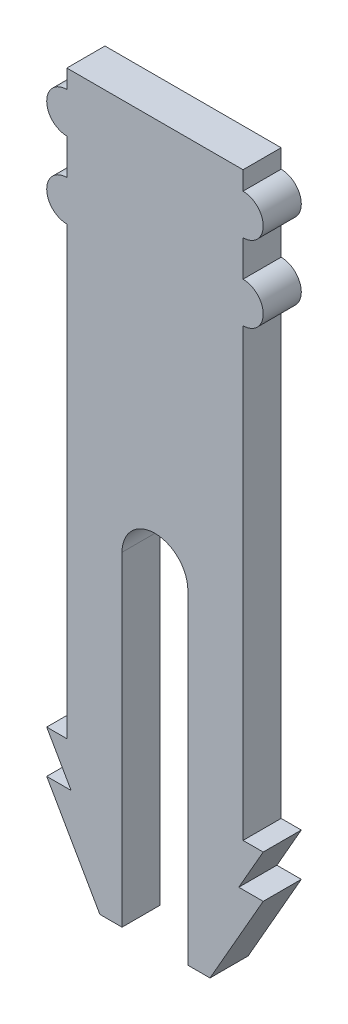
ISO-10303-21;
HEADER;
FILE_DESCRIPTION(('STEP AP214'),'2;1');
FILE_NAME('part.step','',(''),(''),'','','');
FILE_SCHEMA(('AUTOMOTIVE_DESIGN { 1 0 10303 214 1 1 1 1 }'));
ENDSEC;
DATA;
#1=APPLICATION_CONTEXT('core data for automotive mechanical design processes');
#2=APPLICATION_PROTOCOL_DEFINITION('international standard','automotive_design',2000,#1);
#3=PRODUCT_CONTEXT('',#1,'mechanical');
#4=PRODUCT('Part','Part','',(#3));
#5=PRODUCT_RELATED_PRODUCT_CATEGORY('part','',(#4));
#6=PRODUCT_DEFINITION_FORMATION('','',#4);
#7=PRODUCT_DEFINITION_CONTEXT('part definition',#1,'design');
#8=PRODUCT_DEFINITION('design','',#6,#7);
#9=PRODUCT_DEFINITION_SHAPE('','',#8);
#10=(LENGTH_UNIT() NAMED_UNIT(*) SI_UNIT(.MILLI.,.METRE.));
#11=(NAMED_UNIT(*) PLANE_ANGLE_UNIT() SI_UNIT($,.RADIAN.));
#12=(NAMED_UNIT(*) SI_UNIT($,.STERADIAN.) SOLID_ANGLE_UNIT());
#13=UNCERTAINTY_MEASURE_WITH_UNIT(LENGTH_MEASURE(1.E-05),#10,'distance_accuracy_value','');
#14=(GEOMETRIC_REPRESENTATION_CONTEXT(3) GLOBAL_UNCERTAINTY_ASSIGNED_CONTEXT((#13)) GLOBAL_UNIT_ASSIGNED_CONTEXT((#10,
#11,#12)) REPRESENTATION_CONTEXT('',''));
#15=CARTESIAN_POINT('',(0.,0.,0.));
#16=DIRECTION('',(0.,0.,1.));
#17=DIRECTION('',(1.,0.,0.));
#18=AXIS2_PLACEMENT_3D('',#15,#16,#17);
#19=CARTESIAN_POINT('',(-0.71,-1.46,0.125));
#20=DIRECTION('',(0.868042753796934,0.496489453644925,0.));
#21=DIRECTION('',(-0.496489453644925,0.868042753796934,0.));
#22=AXIS2_PLACEMENT_3D('',#19,#20,#21);
#23=PLANE('',#22);
#24=DIRECTION('',(0.496489453644925,-0.868042753796934,0.));
#25=VECTOR('',#24,1.);
#26=CARTESIAN_POINT('',(-0.71,-1.46,-0.125));
#27=LINE('',#26,#25);
#28=CARTESIAN_POINT('',(-0.71,-1.46,-0.125));
#29=VERTEX_POINT('',#28);
#30=CARTESIAN_POINT('',(-0.54985,-1.74,-0.125));
#31=VERTEX_POINT('',#30);
#32=EDGE_CURVE('E11',#29,#31,#27,.T.);
#33=ORIENTED_EDGE('',*,*,#32,.T.);
#34=DIRECTION('',(0.,0.,-1.));
#35=VECTOR('',#34,1.);
#36=CARTESIAN_POINT('',(-0.54985,-1.74,0.125));
#37=LINE('',#36,#35);
#38=CARTESIAN_POINT('',(-0.54985,-1.74,0.125));
#39=VERTEX_POINT('',#38);
#40=EDGE_CURVE('E25',#39,#31,#37,.T.);
#41=ORIENTED_EDGE('',*,*,#40,.F.);
#42=DIRECTION('',(0.496489453644925,-0.868042753796934,0.));
#43=VECTOR('',#42,1.);
#44=CARTESIAN_POINT('',(-0.71,-1.46,0.125));
#45=LINE('',#44,#43);
#46=CARTESIAN_POINT('',(-0.71,-1.46,0.125));
#47=VERTEX_POINT('',#46);
#48=EDGE_CURVE('E499',#47,#39,#45,.T.);
#49=ORIENTED_EDGE('',*,*,#48,.F.);
#50=DIRECTION('',(0.,0.,-1.));
#51=VECTOR('',#50,1.);
#52=CARTESIAN_POINT('',(-0.71,-1.46,0.125));
#53=LINE('',#52,#51);
#54=EDGE_CURVE('E495',#47,#29,#53,.T.);
#55=ORIENTED_EDGE('',*,*,#54,.T.);
#56=EDGE_LOOP('',(#33,#41,#49,#55));
#57=FACE_BOUND('',#56,.T.);
#58=ADVANCED_FACE('F17',(#57),#23,.F.);
#59=CARTESIAN_POINT('',(-0.57785,-1.46,0.125));
#60=DIRECTION('',(0.,-1.,0.));
#61=DIRECTION('',(0.,0.,-1.));
#62=AXIS2_PLACEMENT_3D('',#59,#60,#61);
#63=PLANE('',#62);
#64=DIRECTION('',(-1.,0.,0.));
#65=VECTOR('',#64,1.);
#66=CARTESIAN_POINT('',(-0.57785,-1.46,-0.125));
#67=LINE('',#66,#65);
#68=CARTESIAN_POINT('',(-0.57785,-1.46,-0.125));
#69=VERTEX_POINT('',#68);
#70=EDGE_CURVE('E490',#69,#29,#67,.T.);
#71=ORIENTED_EDGE('',*,*,#70,.T.);
#72=ORIENTED_EDGE('',*,*,#54,.F.);
#73=DIRECTION('',(-1.,0.,0.));
#74=VECTOR('',#73,1.);
#75=CARTESIAN_POINT('',(-0.57785,-1.46,0.125));
#76=LINE('',#75,#74);
#77=CARTESIAN_POINT('',(-0.57785,-1.46,0.125));
#78=VERTEX_POINT('',#77);
#79=EDGE_CURVE('E485',#78,#47,#76,.T.);
#80=ORIENTED_EDGE('',*,*,#79,.F.);
#81=DIRECTION('',(0.,0.,-1.));
#82=VECTOR('',#81,1.);
#83=CARTESIAN_POINT('',(-0.57785,-1.46,0.125));
#84=LINE('',#83,#82);
#85=EDGE_CURVE('E481',#78,#69,#84,.T.);
#86=ORIENTED_EDGE('',*,*,#85,.T.);
#87=EDGE_LOOP('',(#71,#72,#80,#86));
#88=FACE_BOUND('',#87,.T.);
#89=ADVANCED_FACE('F511',(#88),#63,.F.);
#90=CARTESIAN_POINT('',(-0.57785,1.46385,0.125));
#91=DIRECTION('',(1.,0.,0.));
#92=DIRECTION('',(0.,0.,-1.));
#93=AXIS2_PLACEMENT_3D('',#90,#91,#92);
#94=PLANE('',#93);
#95=DIRECTION('',(0.,-1.,0.));
#96=VECTOR('',#95,1.);
#97=CARTESIAN_POINT('',(-0.57785,1.46385,-0.125));
#98=LINE('',#97,#96);
#99=CARTESIAN_POINT('',(-0.57785,1.46385,-0.125));
#100=VERTEX_POINT('',#99);
#101=EDGE_CURVE('E476',#100,#69,#98,.T.);
#102=ORIENTED_EDGE('',*,*,#101,.T.);
#103=ORIENTED_EDGE('',*,*,#85,.F.);
#104=DIRECTION('',(0.,-1.,0.));
#105=VECTOR('',#104,1.);
#106=CARTESIAN_POINT('',(-0.57785,1.46385,0.125));
#107=LINE('',#106,#105);
#108=CARTESIAN_POINT('',(-0.57785,1.46385,0.125));
#109=VERTEX_POINT('',#108);
#110=EDGE_CURVE('E471',#109,#78,#107,.T.);
#111=ORIENTED_EDGE('',*,*,#110,.F.);
#112=DIRECTION('',(0.,0.,-1.));
#113=VECTOR('',#112,1.);
#114=CARTESIAN_POINT('',(-0.57785,1.46385,0.125));
#115=LINE('',#114,#113);
#116=EDGE_CURVE('E467',#109,#100,#115,.T.);
#117=ORIENTED_EDGE('',*,*,#116,.T.);
#118=EDGE_LOOP('',(#102,#103,#111,#117));
#119=FACE_BOUND('',#118,.T.);
#120=ADVANCED_FACE('F518',(#119),#94,.F.);
#121=CARTESIAN_POINT('',(-0.57785,1.596,0.125));
#122=DIRECTION('',(0.,0.,1.));
#123=DIRECTION('',(1.,0.,0.));
#124=AXIS2_PLACEMENT_3D('',#121,#122,#123);
#125=CYLINDRICAL_SURFACE('',#124,0.13215);
#126=CARTESIAN_POINT('',(-0.57785,1.596,-0.125));
#127=DIRECTION('',(0.,0.,1.));
#128=DIRECTION('',(1.,0.,0.));
#129=AXIS2_PLACEMENT_3D('',#126,#127,#128);
#130=CIRCLE('',#129,0.13215);
#131=CARTESIAN_POINT('',(-0.57785,1.72815,-0.125));
#132=VERTEX_POINT('',#131);
#133=EDGE_CURVE('E462',#132,#100,#130,.T.);
#134=ORIENTED_EDGE('',*,*,#133,.T.);
#135=ORIENTED_EDGE('',*,*,#116,.F.);
#136=CARTESIAN_POINT('',(-0.57785,1.596,0.125));
#137=DIRECTION('',(0.,0.,1.));
#138=DIRECTION('',(1.,0.,0.));
#139=AXIS2_PLACEMENT_3D('',#136,#137,#138);
#140=CIRCLE('',#139,0.13215);
#141=CARTESIAN_POINT('',(-0.57785,1.72815,0.125));
#142=VERTEX_POINT('',#141);
#143=EDGE_CURVE('E457',#142,#109,#140,.T.);
#144=ORIENTED_EDGE('',*,*,#143,.F.);
#145=DIRECTION('',(0.,0.,-1.));
#146=VECTOR('',#145,1.);
#147=CARTESIAN_POINT('',(-0.57785,1.72815,0.125));
#148=LINE('',#147,#146);
#149=EDGE_CURVE('E453',#142,#132,#148,.T.);
#150=ORIENTED_EDGE('',*,*,#149,.T.);
#151=EDGE_LOOP('',(#134,#135,#144,#150));
#152=FACE_BOUND('',#151,.T.);
#153=ADVANCED_FACE('F521',(#152),#125,.T.);
#154=CARTESIAN_POINT('',(-0.57785,1.96385,0.125));
#155=DIRECTION('',(1.,0.,0.));
#156=DIRECTION('',(0.,0.,-1.));
#157=AXIS2_PLACEMENT_3D('',#154,#155,#156);
#158=PLANE('',#157);
#159=DIRECTION('',(0.,-1.,0.));
#160=VECTOR('',#159,1.);
#161=CARTESIAN_POINT('',(-0.57785,1.96385,-0.125));
#162=LINE('',#161,#160);
#163=CARTESIAN_POINT('',(-0.57785,1.96385,-0.125));
#164=VERTEX_POINT('',#163);
#165=EDGE_CURVE('E448',#164,#132,#162,.T.);
#166=ORIENTED_EDGE('',*,*,#165,.T.);
#167=ORIENTED_EDGE('',*,*,#149,.F.);
#168=DIRECTION('',(0.,-1.,0.));
#169=VECTOR('',#168,1.);
#170=CARTESIAN_POINT('',(-0.57785,1.96385,0.125));
#171=LINE('',#170,#169);
#172=CARTESIAN_POINT('',(-0.57785,1.96385,0.125));
#173=VERTEX_POINT('',#172);
#174=EDGE_CURVE('E443',#173,#142,#171,.T.);
#175=ORIENTED_EDGE('',*,*,#174,.F.);
#176=DIRECTION('',(0.,0.,-1.));
#177=VECTOR('',#176,1.);
#178=CARTESIAN_POINT('',(-0.57785,1.96385,0.125));
#179=LINE('',#178,#177);
#180=EDGE_CURVE('E439',#173,#164,#179,.T.);
#181=ORIENTED_EDGE('',*,*,#180,.T.);
#182=EDGE_LOOP('',(#166,#167,#175,#181));
#183=FACE_BOUND('',#182,.T.);
#184=ADVANCED_FACE('F524',(#183),#158,.F.);
#185=CARTESIAN_POINT('',(-0.57785,2.096,0.125));
#186=DIRECTION('',(0.,0.,1.));
#187=DIRECTION('',(1.,0.,0.));
#188=AXIS2_PLACEMENT_3D('',#185,#186,#187);
#189=CYLINDRICAL_SURFACE('',#188,0.13215);
#190=CARTESIAN_POINT('',(-0.57785,2.096,-0.125));
#191=DIRECTION('',(0.,0.,1.));
#192=DIRECTION('',(1.,0.,0.));
#193=AXIS2_PLACEMENT_3D('',#190,#191,#192);
#194=CIRCLE('',#193,0.13215);
#195=CARTESIAN_POINT('',(-0.57785,2.22815,-0.125));
#196=VERTEX_POINT('',#195);
#197=EDGE_CURVE('E434',#196,#164,#194,.T.);
#198=ORIENTED_EDGE('',*,*,#197,.T.);
#199=ORIENTED_EDGE('',*,*,#180,.F.);
#200=CARTESIAN_POINT('',(-0.57785,2.096,0.125));
#201=DIRECTION('',(0.,0.,1.));
#202=DIRECTION('',(1.,0.,0.));
#203=AXIS2_PLACEMENT_3D('',#200,#201,#202);
#204=CIRCLE('',#203,0.13215);
#205=CARTESIAN_POINT('',(-0.57785,2.22815,0.125));
#206=VERTEX_POINT('',#205);
#207=EDGE_CURVE('E429',#206,#173,#204,.T.);
#208=ORIENTED_EDGE('',*,*,#207,.F.);
#209=DIRECTION('',(0.,0.,-1.));
#210=VECTOR('',#209,1.);
#211=CARTESIAN_POINT('',(-0.57785,2.22815,0.125));
#212=LINE('',#211,#210);
#213=EDGE_CURVE('E425',#206,#196,#212,.T.);
#214=ORIENTED_EDGE('',*,*,#213,.T.);
#215=EDGE_LOOP('',(#198,#199,#208,#214));
#216=FACE_BOUND('',#215,.T.);
#217=ADVANCED_FACE('F530',(#216),#189,.T.);
#218=CARTESIAN_POINT('',(-0.57785,2.35,0.125));
#219=DIRECTION('',(1.,0.,0.));
#220=DIRECTION('',(0.,0.,-1.));
#221=AXIS2_PLACEMENT_3D('',#218,#219,#220);
#222=PLANE('',#221);
#223=DIRECTION('',(0.,-1.,0.));
#224=VECTOR('',#223,1.);
#225=CARTESIAN_POINT('',(-0.57785,2.35,-0.125));
#226=LINE('',#225,#224);
#227=CARTESIAN_POINT('',(-0.57785,2.35,-0.125));
#228=VERTEX_POINT('',#227);
#229=EDGE_CURVE('E420',#228,#196,#226,.T.);
#230=ORIENTED_EDGE('',*,*,#229,.T.);
#231=ORIENTED_EDGE('',*,*,#213,.F.);
#232=DIRECTION('',(0.,-1.,0.));
#233=VECTOR('',#232,1.);
#234=CARTESIAN_POINT('',(-0.57785,2.35,0.125));
#235=LINE('',#234,#233);
#236=CARTESIAN_POINT('',(-0.57785,2.35,0.125));
#237=VERTEX_POINT('',#236);
#238=EDGE_CURVE('E415',#237,#206,#235,.T.);
#239=ORIENTED_EDGE('',*,*,#238,.F.);
#240=DIRECTION('',(0.,0.,-1.));
#241=VECTOR('',#240,1.);
#242=CARTESIAN_POINT('',(-0.57785,2.35,0.125));
#243=LINE('',#242,#241);
#244=EDGE_CURVE('E411',#237,#228,#243,.T.);
#245=ORIENTED_EDGE('',*,*,#244,.T.);
#246=EDGE_LOOP('',(#230,#231,#239,#245));
#247=FACE_BOUND('',#246,.T.);
#248=ADVANCED_FACE('F533',(#247),#222,.F.);
#249=CARTESIAN_POINT('',(0.57785,2.35,0.125));
#250=DIRECTION('',(0.,-1.,0.));
#251=DIRECTION('',(0.,0.,-1.));
#252=AXIS2_PLACEMENT_3D('',#249,#250,#251);
#253=PLANE('',#252);
#254=DIRECTION('',(-1.,0.,0.));
#255=VECTOR('',#254,1.);
#256=CARTESIAN_POINT('',(0.57785,2.35,-0.125));
#257=LINE('',#256,#255);
#258=CARTESIAN_POINT('',(0.57785,2.35,-0.125));
#259=VERTEX_POINT('',#258);
#260=EDGE_CURVE('E406',#259,#228,#257,.T.);
#261=ORIENTED_EDGE('',*,*,#260,.T.);
#262=ORIENTED_EDGE('',*,*,#244,.F.);
#263=DIRECTION('',(-1.,0.,0.));
#264=VECTOR('',#263,1.);
#265=CARTESIAN_POINT('',(0.57785,2.35,0.125));
#266=LINE('',#265,#264);
#267=CARTESIAN_POINT('',(0.57785,2.35,0.125));
#268=VERTEX_POINT('',#267);
#269=EDGE_CURVE('E401',#268,#237,#266,.T.);
#270=ORIENTED_EDGE('',*,*,#269,.F.);
#271=DIRECTION('',(0.,0.,-1.));
#272=VECTOR('',#271,1.);
#273=CARTESIAN_POINT('',(0.57785,2.35,0.125));
#274=LINE('',#273,#272);
#275=EDGE_CURVE('E397',#268,#259,#274,.T.);
#276=ORIENTED_EDGE('',*,*,#275,.T.);
#277=EDGE_LOOP('',(#261,#262,#270,#276));
#278=FACE_BOUND('',#277,.T.);
#279=ADVANCED_FACE('F536',(#278),#253,.F.);
#280=CARTESIAN_POINT('',(0.57785,2.22815,0.125));
#281=DIRECTION('',(-1.,0.,0.));
#282=DIRECTION('',(0.,0.,1.));
#283=AXIS2_PLACEMENT_3D('',#280,#281,#282);
#284=PLANE('',#283);
#285=DIRECTION('',(0.,1.,0.));
#286=VECTOR('',#285,1.);
#287=CARTESIAN_POINT('',(0.57785,2.22815,-0.125));
#288=LINE('',#287,#286);
#289=CARTESIAN_POINT('',(0.57785,2.22815,-0.125));
#290=VERTEX_POINT('',#289);
#291=EDGE_CURVE('E392',#290,#259,#288,.T.);
#292=ORIENTED_EDGE('',*,*,#291,.T.);
#293=ORIENTED_EDGE('',*,*,#275,.F.);
#294=DIRECTION('',(0.,1.,0.));
#295=VECTOR('',#294,1.);
#296=CARTESIAN_POINT('',(0.57785,2.22815,0.125));
#297=LINE('',#296,#295);
#298=CARTESIAN_POINT('',(0.57785,2.22815,0.125));
#299=VERTEX_POINT('',#298);
#300=EDGE_CURVE('E387',#299,#268,#297,.T.);
#301=ORIENTED_EDGE('',*,*,#300,.F.);
#302=DIRECTION('',(0.,0.,-1.));
#303=VECTOR('',#302,1.);
#304=CARTESIAN_POINT('',(0.57785,2.22815,0.125));
#305=LINE('',#304,#303);
#306=EDGE_CURVE('E383',#299,#290,#305,.T.);
#307=ORIENTED_EDGE('',*,*,#306,.T.);
#308=EDGE_LOOP('',(#292,#293,#301,#307));
#309=FACE_BOUND('',#308,.T.);
#310=ADVANCED_FACE('F542',(#309),#284,.F.);
#311=CARTESIAN_POINT('',(0.57785,2.096,0.125));
#312=DIRECTION('',(0.,0.,1.));
#313=DIRECTION('',(-1.,0.,0.));
#314=AXIS2_PLACEMENT_3D('',#311,#312,#313);
#315=CYLINDRICAL_SURFACE('',#314,0.13215);
#316=CARTESIAN_POINT('',(0.57785,2.096,-0.125));
#317=DIRECTION('',(0.,0.,1.));
#318=DIRECTION('',(1.,0.,0.));
#319=AXIS2_PLACEMENT_3D('',#316,#317,#318);
#320=CIRCLE('',#319,0.13215);
#321=CARTESIAN_POINT('',(0.57785,1.96385,-0.125));
#322=VERTEX_POINT('',#321);
#323=EDGE_CURVE('E378',#322,#290,#320,.T.);
#324=ORIENTED_EDGE('',*,*,#323,.T.);
#325=ORIENTED_EDGE('',*,*,#306,.F.);
#326=CARTESIAN_POINT('',(0.57785,2.096,0.125));
#327=DIRECTION('',(0.,0.,1.));
#328=DIRECTION('',(1.,0.,0.));
#329=AXIS2_PLACEMENT_3D('',#326,#327,#328);
#330=CIRCLE('',#329,0.13215);
#331=CARTESIAN_POINT('',(0.57785,1.96385,0.125));
#332=VERTEX_POINT('',#331);
#333=EDGE_CURVE('E373',#332,#299,#330,.T.);
#334=ORIENTED_EDGE('',*,*,#333,.F.);
#335=DIRECTION('',(0.,0.,-1.));
#336=VECTOR('',#335,1.);
#337=CARTESIAN_POINT('',(0.57785,1.96385,0.125));
#338=LINE('',#337,#336);
#339=EDGE_CURVE('E369',#332,#322,#338,.T.);
#340=ORIENTED_EDGE('',*,*,#339,.T.);
#341=EDGE_LOOP('',(#324,#325,#334,#340));
#342=FACE_BOUND('',#341,.T.);
#343=ADVANCED_FACE('F545',(#342),#315,.T.);
#344=CARTESIAN_POINT('',(0.57785,1.72815,0.125));
#345=DIRECTION('',(-1.,0.,0.));
#346=DIRECTION('',(0.,0.,1.));
#347=AXIS2_PLACEMENT_3D('',#344,#345,#346);
#348=PLANE('',#347);
#349=DIRECTION('',(0.,1.,0.));
#350=VECTOR('',#349,1.);
#351=CARTESIAN_POINT('',(0.57785,1.72815,-0.125));
#352=LINE('',#351,#350);
#353=CARTESIAN_POINT('',(0.57785,1.72815,-0.125));
#354=VERTEX_POINT('',#353);
#355=EDGE_CURVE('E364',#354,#322,#352,.T.);
#356=ORIENTED_EDGE('',*,*,#355,.T.);
#357=ORIENTED_EDGE('',*,*,#339,.F.);
#358=DIRECTION('',(0.,1.,0.));
#359=VECTOR('',#358,1.);
#360=CARTESIAN_POINT('',(0.57785,1.72815,0.125));
#361=LINE('',#360,#359);
#362=CARTESIAN_POINT('',(0.57785,1.72815,0.125));
#363=VERTEX_POINT('',#362);
#364=EDGE_CURVE('E359',#363,#332,#361,.T.);
#365=ORIENTED_EDGE('',*,*,#364,.F.);
#366=DIRECTION('',(0.,0.,-1.));
#367=VECTOR('',#366,1.);
#368=CARTESIAN_POINT('',(0.57785,1.72815,0.125));
#369=LINE('',#368,#367);
#370=EDGE_CURVE('E355',#363,#354,#369,.T.);
#371=ORIENTED_EDGE('',*,*,#370,.T.);
#372=EDGE_LOOP('',(#356,#357,#365,#371));
#373=FACE_BOUND('',#372,.T.);
#374=ADVANCED_FACE('F548',(#373),#348,.F.);
#375=CARTESIAN_POINT('',(0.57785,1.596,0.125));
#376=DIRECTION('',(0.,0.,1.));
#377=DIRECTION('',(-1.,0.,0.));
#378=AXIS2_PLACEMENT_3D('',#375,#376,#377);
#379=CYLINDRICAL_SURFACE('',#378,0.13215);
#380=CARTESIAN_POINT('',(0.57785,1.596,-0.125));
#381=DIRECTION('',(0.,0.,1.));
#382=DIRECTION('',(1.,0.,0.));
#383=AXIS2_PLACEMENT_3D('',#380,#381,#382);
#384=CIRCLE('',#383,0.13215);
#385=CARTESIAN_POINT('',(0.57785,1.46385,-0.125));
#386=VERTEX_POINT('',#385);
#387=EDGE_CURVE('E350',#386,#354,#384,.T.);
#388=ORIENTED_EDGE('',*,*,#387,.T.);
#389=ORIENTED_EDGE('',*,*,#370,.F.);
#390=CARTESIAN_POINT('',(0.57785,1.596,0.125));
#391=DIRECTION('',(0.,0.,1.));
#392=DIRECTION('',(1.,0.,0.));
#393=AXIS2_PLACEMENT_3D('',#390,#391,#392);
#394=CIRCLE('',#393,0.13215);
#395=CARTESIAN_POINT('',(0.57785,1.46385,0.125));
#396=VERTEX_POINT('',#395);
#397=EDGE_CURVE('E345',#396,#363,#394,.T.);
#398=ORIENTED_EDGE('',*,*,#397,.F.);
#399=DIRECTION('',(0.,0.,-1.));
#400=VECTOR('',#399,1.);
#401=CARTESIAN_POINT('',(0.57785,1.46385,0.125));
#402=LINE('',#401,#400);
#403=EDGE_CURVE('E341',#396,#386,#402,.T.);
#404=ORIENTED_EDGE('',*,*,#403,.T.);
#405=EDGE_LOOP('',(#388,#389,#398,#404));
#406=FACE_BOUND('',#405,.T.);
#407=ADVANCED_FACE('F554',(#406),#379,.T.);
#408=CARTESIAN_POINT('',(0.57785,-1.46,0.125));
#409=DIRECTION('',(-1.,0.,0.));
#410=DIRECTION('',(0.,0.,1.));
#411=AXIS2_PLACEMENT_3D('',#408,#409,#410);
#412=PLANE('',#411);
#413=DIRECTION('',(0.,1.,0.));
#414=VECTOR('',#413,1.);
#415=CARTESIAN_POINT('',(0.57785,-1.46,-0.125));
#416=LINE('',#415,#414);
#417=CARTESIAN_POINT('',(0.57785,-1.46,-0.125));
#418=VERTEX_POINT('',#417);
#419=EDGE_CURVE('E336',#418,#386,#416,.T.);
#420=ORIENTED_EDGE('',*,*,#419,.T.);
#421=ORIENTED_EDGE('',*,*,#403,.F.);
#422=DIRECTION('',(0.,1.,0.));
#423=VECTOR('',#422,1.);
#424=CARTESIAN_POINT('',(0.57785,-1.46,0.125));
#425=LINE('',#424,#423);
#426=CARTESIAN_POINT('',(0.57785,-1.46,0.125));
#427=VERTEX_POINT('',#426);
#428=EDGE_CURVE('E331',#427,#396,#425,.T.);
#429=ORIENTED_EDGE('',*,*,#428,.F.);
#430=DIRECTION('',(0.,0.,-1.));
#431=VECTOR('',#430,1.);
#432=CARTESIAN_POINT('',(0.57785,-1.46,0.125));
#433=LINE('',#432,#431);
#434=EDGE_CURVE('E327',#427,#418,#433,.T.);
#435=ORIENTED_EDGE('',*,*,#434,.T.);
#436=EDGE_LOOP('',(#420,#421,#429,#435));
#437=FACE_BOUND('',#436,.T.);
#438=ADVANCED_FACE('F557',(#437),#412,.F.);
#439=CARTESIAN_POINT('',(0.71,-1.46,0.125));
#440=DIRECTION('',(0.,-1.,0.));
#441=DIRECTION('',(0.,0.,-1.));
#442=AXIS2_PLACEMENT_3D('',#439,#440,#441);
#443=PLANE('',#442);
#444=DIRECTION('',(-1.,0.,0.));
#445=VECTOR('',#444,1.);
#446=CARTESIAN_POINT('',(0.71,-1.46,-0.125));
#447=LINE('',#446,#445);
#448=CARTESIAN_POINT('',(0.71,-1.46,-0.125));
#449=VERTEX_POINT('',#448);
#450=EDGE_CURVE('E322',#449,#418,#447,.T.);
#451=ORIENTED_EDGE('',*,*,#450,.T.);
#452=ORIENTED_EDGE('',*,*,#434,.F.);
#453=DIRECTION('',(-1.,0.,0.));
#454=VECTOR('',#453,1.);
#455=CARTESIAN_POINT('',(0.71,-1.46,0.125));
#456=LINE('',#455,#454);
#457=CARTESIAN_POINT('',(0.71,-1.46,0.125));
#458=VERTEX_POINT('',#457);
#459=EDGE_CURVE('E317',#458,#427,#456,.T.);
#460=ORIENTED_EDGE('',*,*,#459,.F.);
#461=DIRECTION('',(0.,0.,-1.));
#462=VECTOR('',#461,1.);
#463=CARTESIAN_POINT('',(0.71,-1.46,0.125));
#464=LINE('',#463,#462);
#465=EDGE_CURVE('E313',#458,#449,#464,.T.);
#466=ORIENTED_EDGE('',*,*,#465,.T.);
#467=EDGE_LOOP('',(#451,#452,#460,#466));
#468=FACE_BOUND('',#467,.T.);
#469=ADVANCED_FACE('F560',(#468),#443,.F.);
#470=CARTESIAN_POINT('',(0.54985,-1.74,0.125));
#471=DIRECTION('',(-0.868042753796934,0.496489453644925,0.));
#472=DIRECTION('',(-0.496489453644925,-0.868042753796934,0.));
#473=AXIS2_PLACEMENT_3D('',#470,#471,#472);
#474=PLANE('',#473);
#475=DIRECTION('',(0.496489453644925,0.868042753796934,0.));
#476=VECTOR('',#475,1.);
#477=CARTESIAN_POINT('',(0.54985,-1.74,-0.125));
#478=LINE('',#477,#476);
#479=CARTESIAN_POINT('',(0.54985,-1.74,-0.125));
#480=VERTEX_POINT('',#479);
#481=EDGE_CURVE('E308',#480,#449,#478,.T.);
#482=ORIENTED_EDGE('',*,*,#481,.T.);
#483=ORIENTED_EDGE('',*,*,#465,.F.);
#484=DIRECTION('',(0.496489453644925,0.868042753796934,0.));
#485=VECTOR('',#484,1.);
#486=CARTESIAN_POINT('',(0.54985,-1.74,0.125));
#487=LINE('',#486,#485);
#488=CARTESIAN_POINT('',(0.54985,-1.74,0.125));
#489=VERTEX_POINT('',#488);
#490=EDGE_CURVE('E303',#489,#458,#487,.T.);
#491=ORIENTED_EDGE('',*,*,#490,.F.);
#492=DIRECTION('',(0.,0.,-1.));
#493=VECTOR('',#492,1.);
#494=CARTESIAN_POINT('',(0.54985,-1.74,0.125));
#495=LINE('',#494,#493);
#496=EDGE_CURVE('E299',#489,#480,#495,.T.);
#497=ORIENTED_EDGE('',*,*,#496,.T.);
#498=EDGE_LOOP('',(#482,#483,#491,#497));
#499=FACE_BOUND('',#498,.T.);
#500=ADVANCED_FACE('F566',(#499),#474,.F.);
#501=CARTESIAN_POINT('',(0.71,-1.74,0.125));
#502=DIRECTION('',(0.,-1.,0.));
#503=DIRECTION('',(0.,0.,-1.));
#504=AXIS2_PLACEMENT_3D('',#501,#502,#503);
#505=PLANE('',#504);
#506=DIRECTION('',(-1.,0.,0.));
#507=VECTOR('',#506,1.);
#508=CARTESIAN_POINT('',(0.71,-1.74,-0.125));
#509=LINE('',#508,#507);
#510=CARTESIAN_POINT('',(0.71,-1.74,-0.125));
#511=VERTEX_POINT('',#510);
#512=EDGE_CURVE('E294',#511,#480,#509,.T.);
#513=ORIENTED_EDGE('',*,*,#512,.T.);
#514=ORIENTED_EDGE('',*,*,#496,.F.);
#515=DIRECTION('',(-1.,0.,0.));
#516=VECTOR('',#515,1.);
#517=CARTESIAN_POINT('',(0.71,-1.74,0.125));
#518=LINE('',#517,#516);
#519=CARTESIAN_POINT('',(0.71,-1.74,0.125));
#520=VERTEX_POINT('',#519);
#521=EDGE_CURVE('E289',#520,#489,#518,.T.);
#522=ORIENTED_EDGE('',*,*,#521,.F.);
#523=DIRECTION('',(0.,0.,-1.));
#524=VECTOR('',#523,1.);
#525=CARTESIAN_POINT('',(0.71,-1.74,0.125));
#526=LINE('',#525,#524);
#527=EDGE_CURVE('E285',#520,#511,#526,.T.);
#528=ORIENTED_EDGE('',*,*,#527,.T.);
#529=EDGE_LOOP('',(#513,#514,#522,#528));
#530=FACE_BOUND('',#529,.T.);
#531=ADVANCED_FACE('F569',(#530),#505,.F.);
#532=CARTESIAN_POINT('',(0.36110178571429,-2.35,0.125));
#533=DIRECTION('',(-0.868042753796936,0.49648945364492,0.));
#534=DIRECTION('',(-0.49648945364492,-0.868042753796936,0.));
#535=AXIS2_PLACEMENT_3D('',#532,#533,#534);
#536=PLANE('',#535);
#537=DIRECTION('',(0.49648945364492,0.868042753796936,0.));
#538=VECTOR('',#537,1.);
#539=CARTESIAN_POINT('',(0.36110178571429,-2.35,-0.125));
#540=LINE('',#539,#538);
#541=CARTESIAN_POINT('',(0.36110178571429,-2.35,-0.125));
#542=VERTEX_POINT('',#541);
#543=EDGE_CURVE('E280',#542,#511,#540,.T.);
#544=ORIENTED_EDGE('',*,*,#543,.T.);
#545=ORIENTED_EDGE('',*,*,#527,.F.);
#546=DIRECTION('',(0.49648945364492,0.868042753796936,0.));
#547=VECTOR('',#546,1.);
#548=CARTESIAN_POINT('',(0.36110178571429,-2.35,0.125));
#549=LINE('',#548,#547);
#550=CARTESIAN_POINT('',(0.36110178571429,-2.35,0.125));
#551=VERTEX_POINT('',#550);
#552=EDGE_CURVE('E275',#551,#520,#549,.T.);
#553=ORIENTED_EDGE('',*,*,#552,.F.);
#554=DIRECTION('',(0.,0.,-1.));
#555=VECTOR('',#554,1.);
#556=CARTESIAN_POINT('',(0.36110178571429,-2.35,0.125));
#557=LINE('',#556,#555);
#558=EDGE_CURVE('E271',#551,#542,#557,.T.);
#559=ORIENTED_EDGE('',*,*,#558,.T.);
#560=EDGE_LOOP('',(#544,#545,#553,#559));
#561=FACE_BOUND('',#560,.T.);
#562=ADVANCED_FACE('F572',(#561),#536,.F.);
#563=CARTESIAN_POINT('',(0.2159,-2.35,0.125));
#564=DIRECTION('',(0.,1.,0.));
#565=DIRECTION('',(0.,0.,1.));
#566=AXIS2_PLACEMENT_3D('',#563,#564,#565);
#567=PLANE('',#566);
#568=DIRECTION('',(1.,0.,0.));
#569=VECTOR('',#568,1.);
#570=CARTESIAN_POINT('',(0.2159,-2.35,-0.125));
#571=LINE('',#570,#569);
#572=CARTESIAN_POINT('',(0.2159,-2.35,-0.125));
#573=VERTEX_POINT('',#572);
#574=EDGE_CURVE('E266',#573,#542,#571,.T.);
#575=ORIENTED_EDGE('',*,*,#574,.T.);
#576=ORIENTED_EDGE('',*,*,#558,.F.);
#577=DIRECTION('',(1.,0.,0.));
#578=VECTOR('',#577,1.);
#579=CARTESIAN_POINT('',(0.2159,-2.35,0.125));
#580=LINE('',#579,#578);
#581=CARTESIAN_POINT('',(0.2159,-2.35,0.125));
#582=VERTEX_POINT('',#581);
#583=EDGE_CURVE('E261',#582,#551,#580,.T.);
#584=ORIENTED_EDGE('',*,*,#583,.F.);
#585=DIRECTION('',(0.,0.,-1.));
#586=VECTOR('',#585,1.);
#587=CARTESIAN_POINT('',(0.2159,-2.35,0.125));
#588=LINE('',#587,#586);
#589=EDGE_CURVE('E257',#582,#573,#588,.T.);
#590=ORIENTED_EDGE('',*,*,#589,.T.);
#591=EDGE_LOOP('',(#575,#576,#584,#590));
#592=FACE_BOUND('',#591,.T.);
#593=ADVANCED_FACE('F577',(#592),#567,.F.);
#594=CARTESIAN_POINT('',(0.2159,-0.22,0.125));
#595=DIRECTION('',(1.,0.,0.));
#596=DIRECTION('',(0.,0.,-1.));
#597=AXIS2_PLACEMENT_3D('',#594,#595,#596);
#598=PLANE('',#597);
#599=DIRECTION('',(0.,-1.,0.));
#600=VECTOR('',#599,1.);
#601=CARTESIAN_POINT('',(0.2159,-0.22,-0.125));
#602=LINE('',#601,#600);
#603=CARTESIAN_POINT('',(0.2159,-0.22,-0.125));
#604=VERTEX_POINT('',#603);
#605=EDGE_CURVE('E252',#604,#573,#602,.T.);
#606=ORIENTED_EDGE('',*,*,#605,.T.);
#607=ORIENTED_EDGE('',*,*,#589,.F.);
#608=DIRECTION('',(0.,-1.,0.));
#609=VECTOR('',#608,1.);
#610=CARTESIAN_POINT('',(0.2159,-0.22,0.125));
#611=LINE('',#610,#609);
#612=CARTESIAN_POINT('',(0.2159,-0.22,0.125));
#613=VERTEX_POINT('',#612);
#614=EDGE_CURVE('E247',#613,#582,#611,.T.);
#615=ORIENTED_EDGE('',*,*,#614,.F.);
#616=DIRECTION('',(0.,0.,-1.));
#617=VECTOR('',#616,1.);
#618=CARTESIAN_POINT('',(0.2159,-0.22,0.125));
#619=LINE('',#618,#617);
#620=EDGE_CURVE('E243',#613,#604,#619,.T.);
#621=ORIENTED_EDGE('',*,*,#620,.T.);
#622=EDGE_LOOP('',(#606,#607,#615,#621));
#623=FACE_BOUND('',#622,.T.);
#624=ADVANCED_FACE('F580',(#623),#598,.F.);
#625=CARTESIAN_POINT('',(0.,-0.219999999999995,0.125));
#626=DIRECTION('',(0.,0.,1.));
#627=DIRECTION('',(0.,-1.,0.));
#628=AXIS2_PLACEMENT_3D('',#625,#626,#627);
#629=CYLINDRICAL_SURFACE('',#628,0.2159);
#630=DIRECTION('',(0.,0.,-1.));
#631=VECTOR('',#630,1.);
#632=CARTESIAN_POINT('',(-0.2159,-0.22,0.125));
#633=LINE('',#632,#631);
#634=CARTESIAN_POINT('',(-0.2159,-0.22,0.125));
#635=VERTEX_POINT('',#634);
#636=CARTESIAN_POINT('',(-0.2159,-0.22,-0.125));
#637=VERTEX_POINT('',#636);
#638=EDGE_CURVE('E239',#635,#637,#633,.T.);
#639=ORIENTED_EDGE('',*,*,#638,.T.);
#640=CARTESIAN_POINT('',(0.,-0.219999999999995,-0.125));
#641=DIRECTION('',(0.,0.,1.));
#642=DIRECTION('',(1.,0.,0.));
#643=AXIS2_PLACEMENT_3D('',#640,#641,#642);
#644=CIRCLE('',#643,0.2159);
#645=EDGE_CURVE('E234',#604,#637,#644,.T.);
#646=ORIENTED_EDGE('',*,*,#645,.F.);
#647=ORIENTED_EDGE('',*,*,#620,.F.);
#648=CARTESIAN_POINT('',(0.,-0.219999999999993,0.125));
#649=DIRECTION('',(0.,0.,1.));
#650=DIRECTION('',(1.,0.,0.));
#651=AXIS2_PLACEMENT_3D('',#648,#649,#650);
#652=CIRCLE('',#651,0.2159);
#653=EDGE_CURVE('E230',#613,#635,#652,.T.);
#654=ORIENTED_EDGE('',*,*,#653,.T.);
#655=EDGE_LOOP('',(#639,#646,#647,#654));
#656=FACE_BOUND('',#655,.T.);
#657=ADVANCED_FACE('F585',(#656),#629,.F.);
#658=CARTESIAN_POINT('',(0.,-0.219999999999993,0.125));
#659=DIRECTION('',(0.,0.,1.));
#660=DIRECTION('',(1.,0.,0.));
#661=AXIS2_PLACEMENT_3D('',#658,#659,#660);
#662=PLANE('',#661);
#663=DIRECTION('',(-1.,0.,0.));
#664=VECTOR('',#663,1.);
#665=CARTESIAN_POINT('',(-0.54985,-1.74,0.125));
#666=LINE('',#665,#664);
#667=CARTESIAN_POINT('',(-0.71,-1.74,0.125));
#668=VERTEX_POINT('',#667);
#669=EDGE_CURVE('E226',#39,#668,#666,.T.);
#670=ORIENTED_EDGE('',*,*,#669,.T.);
#671=DIRECTION('',(0.49648945364492,-0.868042753796936,0.));
#672=VECTOR('',#671,1.);
#673=CARTESIAN_POINT('',(-0.71,-1.74,0.125));
#674=LINE('',#673,#672);
#675=CARTESIAN_POINT('',(-0.36110178571429,-2.35,0.125));
#676=VERTEX_POINT('',#675);
#677=EDGE_CURVE('E181',#668,#676,#674,.T.);
#678=ORIENTED_EDGE('',*,*,#677,.T.);
#679=DIRECTION('',(1.,0.,0.));
#680=VECTOR('',#679,1.);
#681=CARTESIAN_POINT('',(-0.36110178571429,-2.35,0.125));
#682=LINE('',#681,#680);
#683=CARTESIAN_POINT('',(-0.2159,-2.35,0.125));
#684=VERTEX_POINT('',#683);
#685=EDGE_CURVE('E219',#676,#684,#682,.T.);
#686=ORIENTED_EDGE('',*,*,#685,.T.);
#687=DIRECTION('',(0.,1.,0.));
#688=VECTOR('',#687,1.);
#689=CARTESIAN_POINT('',(-0.2159,-2.35,0.125));
#690=LINE('',#689,#688);
#691=EDGE_CURVE('E214',#684,#635,#690,.T.);
#692=ORIENTED_EDGE('',*,*,#691,.T.);
#693=ORIENTED_EDGE('',*,*,#653,.F.);
#694=ORIENTED_EDGE('',*,*,#614,.T.);
#695=ORIENTED_EDGE('',*,*,#583,.T.);
#696=ORIENTED_EDGE('',*,*,#552,.T.);
#697=ORIENTED_EDGE('',*,*,#521,.T.);
#698=ORIENTED_EDGE('',*,*,#490,.T.);
#699=ORIENTED_EDGE('',*,*,#459,.T.);
#700=ORIENTED_EDGE('',*,*,#428,.T.);
#701=ORIENTED_EDGE('',*,*,#397,.T.);
#702=ORIENTED_EDGE('',*,*,#364,.T.);
#703=ORIENTED_EDGE('',*,*,#333,.T.);
#704=ORIENTED_EDGE('',*,*,#300,.T.);
#705=ORIENTED_EDGE('',*,*,#269,.T.);
#706=ORIENTED_EDGE('',*,*,#238,.T.);
#707=ORIENTED_EDGE('',*,*,#207,.T.);
#708=ORIENTED_EDGE('',*,*,#174,.T.);
#709=ORIENTED_EDGE('',*,*,#143,.T.);
#710=ORIENTED_EDGE('',*,*,#110,.T.);
#711=ORIENTED_EDGE('',*,*,#79,.T.);
#712=ORIENTED_EDGE('',*,*,#48,.T.);
#713=EDGE_LOOP('',(#670,#678,#686,#692,#693,#694,#695,#696,#697,#698,#699,#700,#701,#702,#703,
#704,#705,#706,#707,#708,#709,#710,#711,#712));
#714=FACE_BOUND('',#713,.T.);
#715=ADVANCED_FACE('F508',(#714),#662,.T.);
#716=CARTESIAN_POINT('',(-0.2159,-2.35,0.125));
#717=DIRECTION('',(-1.,0.,0.));
#718=DIRECTION('',(0.,0.,1.));
#719=AXIS2_PLACEMENT_3D('',#716,#717,#718);
#720=PLANE('',#719);
#721=DIRECTION('',(0.,1.,0.));
#722=VECTOR('',#721,1.);
#723=CARTESIAN_POINT('',(-0.2159,-2.35,-0.125));
#724=LINE('',#723,#722);
#725=CARTESIAN_POINT('',(-0.2159,-2.35,-0.125));
#726=VERTEX_POINT('',#725);
#727=EDGE_CURVE('E209',#726,#637,#724,.T.);
#728=ORIENTED_EDGE('',*,*,#727,.T.);
#729=ORIENTED_EDGE('',*,*,#638,.F.);
#730=ORIENTED_EDGE('',*,*,#691,.F.);
#731=DIRECTION('',(0.,0.,-1.));
#732=VECTOR('',#731,1.);
#733=CARTESIAN_POINT('',(-0.2159,-2.35,0.125));
#734=LINE('',#733,#732);
#735=EDGE_CURVE('E205',#684,#726,#734,.T.);
#736=ORIENTED_EDGE('',*,*,#735,.T.);
#737=EDGE_LOOP('',(#728,#729,#730,#736));
#738=FACE_BOUND('',#737,.T.);
#739=ADVANCED_FACE('F588',(#738),#720,.F.);
#740=CARTESIAN_POINT('',(-0.36110178571429,-2.35,0.125));
#741=DIRECTION('',(0.,1.,0.));
#742=DIRECTION('',(0.,0.,1.));
#743=AXIS2_PLACEMENT_3D('',#740,#741,#742);
#744=PLANE('',#743);
#745=DIRECTION('',(1.,0.,0.));
#746=VECTOR('',#745,1.);
#747=CARTESIAN_POINT('',(-0.36110178571429,-2.35,-0.125));
#748=LINE('',#747,#746);
#749=CARTESIAN_POINT('',(-0.36110178571429,-2.35,-0.125));
#750=VERTEX_POINT('',#749);
#751=EDGE_CURVE('E193',#750,#726,#748,.T.);
#752=ORIENTED_EDGE('',*,*,#751,.T.);
#753=ORIENTED_EDGE('',*,*,#735,.F.);
#754=ORIENTED_EDGE('',*,*,#685,.F.);
#755=DIRECTION('',(0.,0.,-1.));
#756=VECTOR('',#755,1.);
#757=CARTESIAN_POINT('',(-0.36110178571429,-2.35,0.125));
#758=LINE('',#757,#756);
#759=EDGE_CURVE('E194',#676,#750,#758,.T.);
#760=ORIENTED_EDGE('',*,*,#759,.T.);
#761=EDGE_LOOP('',(#752,#753,#754,#760));
#762=FACE_BOUND('',#761,.T.);
#763=ADVANCED_FACE('F593',(#762),#744,.F.);
#764=CARTESIAN_POINT('',(-0.71,-1.74,0.125));
#765=DIRECTION('',(0.868042753796936,0.49648945364492,0.));
#766=DIRECTION('',(-0.49648945364492,0.868042753796936,0.));
#767=AXIS2_PLACEMENT_3D('',#764,#765,#766);
#768=PLANE('',#767);
#769=DIRECTION('',(0.49648945364492,-0.868042753796936,0.));
#770=VECTOR('',#769,1.);
#771=CARTESIAN_POINT('',(-0.71,-1.74,-0.125));
#772=LINE('',#771,#770);
#773=CARTESIAN_POINT('',(-0.71,-1.74,-0.125));
#774=VERTEX_POINT('',#773);
#775=EDGE_CURVE('E179',#774,#750,#772,.T.);
#776=ORIENTED_EDGE('',*,*,#775,.T.);
#777=ORIENTED_EDGE('',*,*,#759,.F.);
#778=ORIENTED_EDGE('',*,*,#677,.F.);
#779=DIRECTION('',(0.,0.,-1.));
#780=VECTOR('',#779,1.);
#781=CARTESIAN_POINT('',(-0.71,-1.74,0.125));
#782=LINE('',#781,#780);
#783=EDGE_CURVE('E174',#668,#774,#782,.T.);
#784=ORIENTED_EDGE('',*,*,#783,.T.);
#785=EDGE_LOOP('',(#776,#777,#778,#784));
#786=FACE_BOUND('',#785,.T.);
#787=ADVANCED_FACE('F176',(#786),#768,.F.);
#788=CARTESIAN_POINT('',(-0.54985,-1.74,0.125));
#789=DIRECTION('',(0.,-1.,0.));
#790=DIRECTION('',(0.,0.,-1.));
#791=AXIS2_PLACEMENT_3D('',#788,#789,#790);
#792=PLANE('',#791);
#793=DIRECTION('',(-1.,0.,0.));
#794=VECTOR('',#793,1.);
#795=CARTESIAN_POINT('',(-0.54985,-1.74,-0.125));
#796=LINE('',#795,#794);
#797=EDGE_CURVE('E184',#31,#774,#796,.T.);
#798=ORIENTED_EDGE('',*,*,#797,.T.);
#799=ORIENTED_EDGE('',*,*,#783,.F.);
#800=ORIENTED_EDGE('',*,*,#669,.F.);
#801=ORIENTED_EDGE('',*,*,#40,.T.);
#802=EDGE_LOOP('',(#798,#799,#800,#801));
#803=FACE_BOUND('',#802,.T.);
#804=ADVANCED_FACE('F187',(#803),#792,.F.);
#805=CARTESIAN_POINT('',(0.,-0.219999999999993,-0.125));
#806=DIRECTION('',(0.,0.,1.));
#807=DIRECTION('',(1.,0.,0.));
#808=AXIS2_PLACEMENT_3D('',#805,#806,#807);
#809=PLANE('',#808);
#810=ORIENTED_EDGE('',*,*,#797,.F.);
#811=ORIENTED_EDGE('',*,*,#32,.F.);
#812=ORIENTED_EDGE('',*,*,#70,.F.);
#813=ORIENTED_EDGE('',*,*,#101,.F.);
#814=ORIENTED_EDGE('',*,*,#133,.F.);
#815=ORIENTED_EDGE('',*,*,#165,.F.);
#816=ORIENTED_EDGE('',*,*,#197,.F.);
#817=ORIENTED_EDGE('',*,*,#229,.F.);
#818=ORIENTED_EDGE('',*,*,#260,.F.);
#819=ORIENTED_EDGE('',*,*,#291,.F.);
#820=ORIENTED_EDGE('',*,*,#323,.F.);
#821=ORIENTED_EDGE('',*,*,#355,.F.);
#822=ORIENTED_EDGE('',*,*,#387,.F.);
#823=ORIENTED_EDGE('',*,*,#419,.F.);
#824=ORIENTED_EDGE('',*,*,#450,.F.);
#825=ORIENTED_EDGE('',*,*,#481,.F.);
#826=ORIENTED_EDGE('',*,*,#512,.F.);
#827=ORIENTED_EDGE('',*,*,#543,.F.);
#828=ORIENTED_EDGE('',*,*,#574,.F.);
#829=ORIENTED_EDGE('',*,*,#605,.F.);
#830=ORIENTED_EDGE('',*,*,#645,.T.);
#831=ORIENTED_EDGE('',*,*,#727,.F.);
#832=ORIENTED_EDGE('',*,*,#751,.F.);
#833=ORIENTED_EDGE('',*,*,#775,.F.);
#834=EDGE_LOOP('',(#810,#811,#812,#813,#814,#815,#816,#817,#818,#819,#820,#821,#822,#823,#824,
#825,#826,#827,#828,#829,#830,#831,#832,#833));
#835=FACE_BOUND('',#834,.T.);
#836=ADVANCED_FACE('F190',(#835),#809,.F.);
#837=CLOSED_SHELL('',(#58,#89,#120,#153,#184,#217,#248,#279,#310,#343,#374,#407,#438,#469,#500,
#531,#562,#593,#624,#657,#715,#739,#763,#787,#804,#836));
#838=MANIFOLD_SOLID_BREP('B1',#837);
#839=ADVANCED_BREP_SHAPE_REPRESENTATION('',(#18,#838),#14);
#840=SHAPE_DEFINITION_REPRESENTATION(#9,#839);
ENDSEC;
END-ISO-10303-21;
